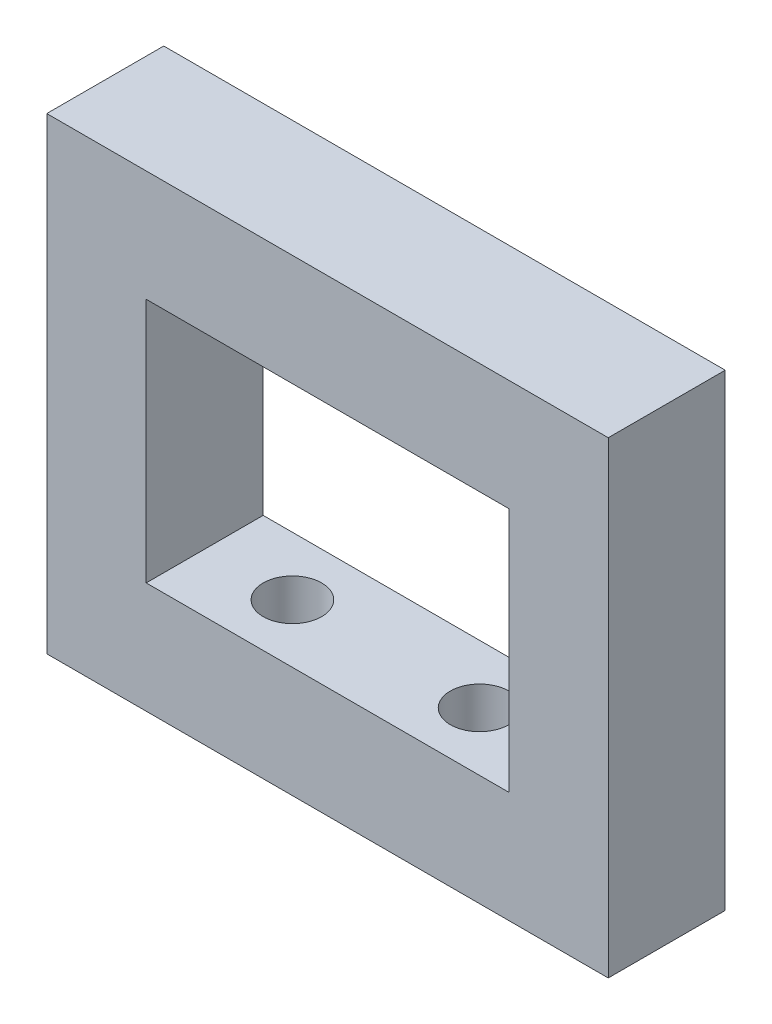
ISO-10303-21;
HEADER;
FILE_DESCRIPTION(('STEP AP214'),'2;1');
FILE_NAME('part.step','',(''),(''),'','','');
FILE_SCHEMA(('AUTOMOTIVE_DESIGN { 1 0 10303 214 1 1 1 1 }'));
ENDSEC;
DATA;
#1=APPLICATION_CONTEXT('core data for automotive mechanical design processes');
#2=APPLICATION_PROTOCOL_DEFINITION('international standard','automotive_design',2000,#1);
#3=PRODUCT_CONTEXT('',#1,'mechanical');
#4=PRODUCT('Part','Part','',(#3));
#5=PRODUCT_RELATED_PRODUCT_CATEGORY('part','',(#4));
#6=PRODUCT_DEFINITION_FORMATION('','',#4);
#7=PRODUCT_DEFINITION_CONTEXT('part definition',#1,'design');
#8=PRODUCT_DEFINITION('design','',#6,#7);
#9=PRODUCT_DEFINITION_SHAPE('','',#8);
#10=(LENGTH_UNIT() NAMED_UNIT(*) SI_UNIT(.MILLI.,.METRE.));
#11=(NAMED_UNIT(*) PLANE_ANGLE_UNIT() SI_UNIT($,.RADIAN.));
#12=(NAMED_UNIT(*) SI_UNIT($,.STERADIAN.) SOLID_ANGLE_UNIT());
#13=UNCERTAINTY_MEASURE_WITH_UNIT(LENGTH_MEASURE(1.E-05),#10,'distance_accuracy_value','');
#14=(GEOMETRIC_REPRESENTATION_CONTEXT(3) GLOBAL_UNCERTAINTY_ASSIGNED_CONTEXT((#13)) GLOBAL_UNIT_ASSIGNED_CONTEXT((#10,
#11,#12)) REPRESENTATION_CONTEXT('',''));
#15=CARTESIAN_POINT('',(0.,0.,0.));
#16=DIRECTION('',(0.,0.,1.));
#17=DIRECTION('',(1.,0.,0.));
#18=AXIS2_PLACEMENT_3D('',#15,#16,#17);
#19=CARTESIAN_POINT('',(12.,-10.,2.5));
#20=DIRECTION('',(-1.,0.,0.));
#21=DIRECTION('',(0.,0.,1.));
#22=AXIS2_PLACEMENT_3D('',#19,#20,#21);
#23=PLANE('',#22);
#24=DIRECTION('',(0.,1.,0.));
#25=VECTOR('',#24,1.);
#26=CARTESIAN_POINT('',(12.,-10.,-2.5));
#27=LINE('',#26,#25);
#28=CARTESIAN_POINT('',(12.,-10.,-2.5));
#29=VERTEX_POINT('',#28);
#30=CARTESIAN_POINT('',(12.,10.,-2.5));
#31=VERTEX_POINT('',#30);
#32=EDGE_CURVE('E134',#29,#31,#27,.T.);
#33=ORIENTED_EDGE('',*,*,#32,.T.);
#34=DIRECTION('',(0.,0.,-1.));
#35=VECTOR('',#34,1.);
#36=CARTESIAN_POINT('',(12.,10.,2.5));
#37=LINE('',#36,#35);
#38=CARTESIAN_POINT('',(12.,10.,2.5));
#39=VERTEX_POINT('',#38);
#40=EDGE_CURVE('E11',#39,#31,#37,.T.);
#41=ORIENTED_EDGE('',*,*,#40,.F.);
#42=DIRECTION('',(0.,1.,0.));
#43=VECTOR('',#42,1.);
#44=CARTESIAN_POINT('',(12.,-10.,2.5));
#45=LINE('',#44,#43);
#46=CARTESIAN_POINT('',(12.,-10.,2.5));
#47=VERTEX_POINT('',#46);
#48=EDGE_CURVE('E138',#47,#39,#45,.T.);
#49=ORIENTED_EDGE('',*,*,#48,.F.);
#50=DIRECTION('',(0.,0.,-1.));
#51=VECTOR('',#50,1.);
#52=CARTESIAN_POINT('',(12.,-10.,2.5));
#53=LINE('',#52,#51);
#54=EDGE_CURVE('E148',#47,#29,#53,.T.);
#55=ORIENTED_EDGE('',*,*,#54,.T.);
#56=EDGE_LOOP('',(#33,#41,#49,#55));
#57=FACE_BOUND('',#56,.T.);
#58=ADVANCED_FACE('F33',(#57),#23,.F.);
#59=CARTESIAN_POINT('',(-12.,10.,2.5));
#60=DIRECTION('',(0.,-1.,0.));
#61=DIRECTION('',(0.,0.,-1.));
#62=AXIS2_PLACEMENT_3D('',#59,#60,#61);
#63=PLANE('',#62);
#64=DIRECTION('',(-1.,0.,0.));
#65=VECTOR('',#64,1.);
#66=CARTESIAN_POINT('',(-12.,10.,-2.5));
#67=LINE('',#66,#65);
#68=CARTESIAN_POINT('',(-12.,10.,-2.5));
#69=VERTEX_POINT('',#68);
#70=EDGE_CURVE('E151',#31,#69,#67,.T.);
#71=ORIENTED_EDGE('',*,*,#70,.T.);
#72=DIRECTION('',(0.,0.,-1.));
#73=VECTOR('',#72,1.);
#74=CARTESIAN_POINT('',(-12.,10.,2.5));
#75=LINE('',#74,#73);
#76=CARTESIAN_POINT('',(-12.,10.,2.5));
#77=VERTEX_POINT('',#76);
#78=EDGE_CURVE('E40',#77,#69,#75,.T.);
#79=ORIENTED_EDGE('',*,*,#78,.F.);
#80=DIRECTION('',(-1.,0.,0.));
#81=VECTOR('',#80,1.);
#82=CARTESIAN_POINT('',(-12.,10.,2.5));
#83=LINE('',#82,#81);
#84=EDGE_CURVE('E141',#39,#77,#83,.T.);
#85=ORIENTED_EDGE('',*,*,#84,.F.);
#86=ORIENTED_EDGE('',*,*,#40,.T.);
#87=EDGE_LOOP('',(#71,#79,#85,#86));
#88=FACE_BOUND('',#87,.T.);
#89=ADVANCED_FACE('F179',(#88),#63,.F.);
#90=CARTESIAN_POINT('',(-12.,-10.,2.5));
#91=DIRECTION('',(1.,0.,0.));
#92=DIRECTION('',(0.,0.,-1.));
#93=AXIS2_PLACEMENT_3D('',#90,#91,#92);
#94=PLANE('',#93);
#95=DIRECTION('',(0.,-1.,0.));
#96=VECTOR('',#95,1.);
#97=CARTESIAN_POINT('',(-12.,-10.,-2.5));
#98=LINE('',#97,#96);
#99=CARTESIAN_POINT('',(-12.,-10.,-2.5));
#100=VERTEX_POINT('',#99);
#101=EDGE_CURVE('E153',#69,#100,#98,.T.);
#102=ORIENTED_EDGE('',*,*,#101,.T.);
#103=DIRECTION('',(0.,0.,-1.));
#104=VECTOR('',#103,1.);
#105=CARTESIAN_POINT('',(-12.,-10.,2.5));
#106=LINE('',#105,#104);
#107=CARTESIAN_POINT('',(-12.,-10.,2.5));
#108=VERTEX_POINT('',#107);
#109=EDGE_CURVE('E158',#108,#100,#106,.T.);
#110=ORIENTED_EDGE('',*,*,#109,.F.);
#111=DIRECTION('',(0.,-1.,0.));
#112=VECTOR('',#111,1.);
#113=CARTESIAN_POINT('',(-12.,-10.,2.5));
#114=LINE('',#113,#112);
#115=EDGE_CURVE('E144',#77,#108,#114,.T.);
#116=ORIENTED_EDGE('',*,*,#115,.F.);
#117=ORIENTED_EDGE('',*,*,#78,.T.);
#118=EDGE_LOOP('',(#102,#110,#116,#117));
#119=FACE_BOUND('',#118,.T.);
#120=ADVANCED_FACE('F165',(#119),#94,.F.);
#121=CARTESIAN_POINT('',(-12.,-10.,2.5));
#122=DIRECTION('',(0.,1.,0.));
#123=DIRECTION('',(0.,0.,1.));
#124=AXIS2_PLACEMENT_3D('',#121,#122,#123);
#125=PLANE('',#124);
#126=CARTESIAN_POINT('',(-4.,-10.,0.));
#127=DIRECTION('',(0.,-1.,0.));
#128=DIRECTION('',(0.,0.,-1.));
#129=AXIS2_PLACEMENT_3D('',#126,#127,#128);
#130=CIRCLE('',#129,1.25);
#131=CARTESIAN_POINT('',(-4.,-10.,-1.25));
#132=VERTEX_POINT('',#131);
#133=EDGE_CURVE('E218',#132,#132,#130,.T.);
#134=ORIENTED_EDGE('',*,*,#133,.F.);
#135=EDGE_LOOP('',(#134));
#136=FACE_BOUND('',#135,.T.);
#137=CARTESIAN_POINT('',(4.,-10.,0.));
#138=DIRECTION('',(0.,-1.,0.));
#139=DIRECTION('',(0.,0.,-1.));
#140=AXIS2_PLACEMENT_3D('',#137,#138,#139);
#141=CIRCLE('',#140,1.25);
#142=CARTESIAN_POINT('',(4.,-10.,-1.25));
#143=VERTEX_POINT('',#142);
#144=EDGE_CURVE('E223',#143,#143,#141,.T.);
#145=ORIENTED_EDGE('',*,*,#144,.F.);
#146=EDGE_LOOP('',(#145));
#147=FACE_BOUND('',#146,.T.);
#148=DIRECTION('',(1.,0.,0.));
#149=VECTOR('',#148,1.);
#150=CARTESIAN_POINT('',(-12.,-10.,-2.5));
#151=LINE('',#150,#149);
#152=EDGE_CURVE('E142',#100,#29,#151,.T.);
#153=ORIENTED_EDGE('',*,*,#152,.T.);
#154=ORIENTED_EDGE('',*,*,#54,.F.);
#155=DIRECTION('',(1.,0.,0.));
#156=VECTOR('',#155,1.);
#157=CARTESIAN_POINT('',(-12.,-10.,2.5));
#158=LINE('',#157,#156);
#159=EDGE_CURVE('E146',#108,#47,#158,.T.);
#160=ORIENTED_EDGE('',*,*,#159,.F.);
#161=ORIENTED_EDGE('',*,*,#109,.T.);
#162=EDGE_LOOP('',(#153,#154,#160,#161));
#163=FACE_BOUND('',#162,.T.);
#164=ADVANCED_FACE('F172',(#136,#147,#163),#125,.F.);
#165=CARTESIAN_POINT('',(0.,0.,2.5));
#166=DIRECTION('',(0.,0.,-1.));
#167=DIRECTION('',(-1.,0.,0.));
#168=AXIS2_PLACEMENT_3D('',#165,#166,#167);
#169=PLANE('',#168);
#170=DIRECTION('',(-1.,0.,0.));
#171=VECTOR('',#170,1.);
#172=CARTESIAN_POINT('',(-7.75,5.25,2.5));
#173=LINE('',#172,#171);
#174=CARTESIAN_POINT('',(7.75,5.25,2.5));
#175=VERTEX_POINT('',#174);
#176=CARTESIAN_POINT('',(-7.75,5.25,2.5));
#177=VERTEX_POINT('',#176);
#178=EDGE_CURVE('E127',#175,#177,#173,.T.);
#179=ORIENTED_EDGE('',*,*,#178,.F.);
#180=DIRECTION('',(0.,1.,0.));
#181=VECTOR('',#180,1.);
#182=CARTESIAN_POINT('',(7.75,-5.25,2.5));
#183=LINE('',#182,#181);
#184=CARTESIAN_POINT('',(7.75,-5.25,2.5));
#185=VERTEX_POINT('',#184);
#186=EDGE_CURVE('E47',#185,#175,#183,.T.);
#187=ORIENTED_EDGE('',*,*,#186,.F.);
#188=DIRECTION('',(1.,0.,0.));
#189=VECTOR('',#188,1.);
#190=CARTESIAN_POINT('',(-7.75,-5.25,2.5));
#191=LINE('',#190,#189);
#192=CARTESIAN_POINT('',(-7.75,-5.25,2.5));
#193=VERTEX_POINT('',#192);
#194=EDGE_CURVE('E115',#193,#185,#191,.T.);
#195=ORIENTED_EDGE('',*,*,#194,.F.);
#196=DIRECTION('',(0.,-1.,0.));
#197=VECTOR('',#196,1.);
#198=CARTESIAN_POINT('',(-7.75,-5.25,2.5));
#199=LINE('',#198,#197);
#200=EDGE_CURVE('E118',#177,#193,#199,.T.);
#201=ORIENTED_EDGE('',*,*,#200,.F.);
#202=EDGE_LOOP('',(#179,#187,#195,#201));
#203=FACE_BOUND('',#202,.T.);
#204=ORIENTED_EDGE('',*,*,#48,.T.);
#205=ORIENTED_EDGE('',*,*,#84,.T.);
#206=ORIENTED_EDGE('',*,*,#115,.T.);
#207=ORIENTED_EDGE('',*,*,#159,.T.);
#208=EDGE_LOOP('',(#204,#205,#206,#207));
#209=FACE_BOUND('',#208,.T.);
#210=ADVANCED_FACE('F178',(#203,#209),#169,.F.);
#211=CARTESIAN_POINT('',(0.,0.,-2.5));
#212=DIRECTION('',(0.,0.,-1.));
#213=DIRECTION('',(-1.,0.,0.));
#214=AXIS2_PLACEMENT_3D('',#211,#212,#213);
#215=PLANE('',#214);
#216=DIRECTION('',(0.,1.,0.));
#217=VECTOR('',#216,1.);
#218=CARTESIAN_POINT('',(7.75,-5.25,-2.5));
#219=LINE('',#218,#217);
#220=CARTESIAN_POINT('',(7.75,-5.25,-2.5));
#221=VERTEX_POINT('',#220);
#222=CARTESIAN_POINT('',(7.75,5.25,-2.5));
#223=VERTEX_POINT('',#222);
#224=EDGE_CURVE('E99',#221,#223,#219,.T.);
#225=ORIENTED_EDGE('',*,*,#224,.T.);
#226=DIRECTION('',(-1.,0.,0.));
#227=VECTOR('',#226,1.);
#228=CARTESIAN_POINT('',(-7.75,5.25,-2.5));
#229=LINE('',#228,#227);
#230=CARTESIAN_POINT('',(-7.75,5.25,-2.5));
#231=VERTEX_POINT('',#230);
#232=EDGE_CURVE('E108',#223,#231,#229,.T.);
#233=ORIENTED_EDGE('',*,*,#232,.T.);
#234=DIRECTION('',(0.,-1.,0.));
#235=VECTOR('',#234,1.);
#236=CARTESIAN_POINT('',(-7.75,-5.25,-2.5));
#237=LINE('',#236,#235);
#238=CARTESIAN_POINT('',(-7.75,-5.25,-2.5));
#239=VERTEX_POINT('',#238);
#240=EDGE_CURVE('E55',#231,#239,#237,.T.);
#241=ORIENTED_EDGE('',*,*,#240,.T.);
#242=DIRECTION('',(1.,0.,0.));
#243=VECTOR('',#242,1.);
#244=CARTESIAN_POINT('',(-7.75,-5.25,-2.5));
#245=LINE('',#244,#243);
#246=EDGE_CURVE('E105',#239,#221,#245,.T.);
#247=ORIENTED_EDGE('',*,*,#246,.T.);
#248=EDGE_LOOP('',(#225,#233,#241,#247));
#249=FACE_BOUND('',#248,.T.);
#250=ORIENTED_EDGE('',*,*,#32,.F.);
#251=ORIENTED_EDGE('',*,*,#152,.F.);
#252=ORIENTED_EDGE('',*,*,#101,.F.);
#253=ORIENTED_EDGE('',*,*,#70,.F.);
#254=EDGE_LOOP('',(#250,#251,#252,#253));
#255=FACE_BOUND('',#254,.T.);
#256=ADVANCED_FACE('F112',(#249,#255),#215,.T.);
#257=CARTESIAN_POINT('',(7.75,-5.25,-2.5));
#258=DIRECTION('',(1.,0.,0.));
#259=DIRECTION('',(0.,0.,-1.));
#260=AXIS2_PLACEMENT_3D('',#257,#258,#259);
#261=PLANE('',#260);
#262=ORIENTED_EDGE('',*,*,#186,.T.);
#263=DIRECTION('',(0.,0.,1.));
#264=VECTOR('',#263,1.);
#265=CARTESIAN_POINT('',(7.75,5.25,-2.5));
#266=LINE('',#265,#264);
#267=EDGE_CURVE('E95',#223,#175,#266,.T.);
#268=ORIENTED_EDGE('',*,*,#267,.F.);
#269=ORIENTED_EDGE('',*,*,#224,.F.);
#270=DIRECTION('',(0.,0.,1.));
#271=VECTOR('',#270,1.);
#272=CARTESIAN_POINT('',(7.75,-5.25,-2.5));
#273=LINE('',#272,#271);
#274=EDGE_CURVE('E132',#221,#185,#273,.T.);
#275=ORIENTED_EDGE('',*,*,#274,.T.);
#276=EDGE_LOOP('',(#262,#268,#269,#275));
#277=FACE_BOUND('',#276,.T.);
#278=ADVANCED_FACE('F97',(#277),#261,.F.);
#279=CARTESIAN_POINT('',(-7.75,-5.25,-2.5));
#280=DIRECTION('',(0.,-1.,0.));
#281=DIRECTION('',(0.,0.,-1.));
#282=AXIS2_PLACEMENT_3D('',#279,#280,#281);
#283=PLANE('',#282);
#284=CARTESIAN_POINT('',(-4.,-5.25,0.));
#285=DIRECTION('',(0.,-1.,0.));
#286=DIRECTION('',(0.,0.,-1.));
#287=AXIS2_PLACEMENT_3D('',#284,#285,#286);
#288=CIRCLE('',#287,1.25);
#289=CARTESIAN_POINT('',(-4.,-5.25,-1.25));
#290=VERTEX_POINT('',#289);
#291=EDGE_CURVE('E128',#290,#290,#288,.F.);
#292=ORIENTED_EDGE('',*,*,#291,.F.);
#293=EDGE_LOOP('',(#292));
#294=FACE_BOUND('',#293,.T.);
#295=CARTESIAN_POINT('',(4.,-5.25,0.));
#296=DIRECTION('',(0.,-1.,0.));
#297=DIRECTION('',(0.,0.,-1.));
#298=AXIS2_PLACEMENT_3D('',#295,#296,#297);
#299=CIRCLE('',#298,1.25);
#300=CARTESIAN_POINT('',(4.,-5.25,-1.25));
#301=VERTEX_POINT('',#300);
#302=EDGE_CURVE('E121',#301,#301,#299,.F.);
#303=ORIENTED_EDGE('',*,*,#302,.F.);
#304=EDGE_LOOP('',(#303));
#305=FACE_BOUND('',#304,.T.);
#306=ORIENTED_EDGE('',*,*,#194,.T.);
#307=ORIENTED_EDGE('',*,*,#274,.F.);
#308=ORIENTED_EDGE('',*,*,#246,.F.);
#309=DIRECTION('',(0.,0.,1.));
#310=VECTOR('',#309,1.);
#311=CARTESIAN_POINT('',(-7.75,-5.25,-2.5));
#312=LINE('',#311,#310);
#313=EDGE_CURVE('E135',#239,#193,#312,.T.);
#314=ORIENTED_EDGE('',*,*,#313,.T.);
#315=EDGE_LOOP('',(#306,#307,#308,#314));
#316=FACE_BOUND('',#315,.T.);
#317=ADVANCED_FACE('F197',(#294,#305,#316),#283,.F.);
#318=CARTESIAN_POINT('',(-7.75,-5.25,-2.5));
#319=DIRECTION('',(-1.,0.,0.));
#320=DIRECTION('',(0.,0.,1.));
#321=AXIS2_PLACEMENT_3D('',#318,#319,#320);
#322=PLANE('',#321);
#323=ORIENTED_EDGE('',*,*,#200,.T.);
#324=ORIENTED_EDGE('',*,*,#313,.F.);
#325=ORIENTED_EDGE('',*,*,#240,.F.);
#326=DIRECTION('',(0.,0.,1.));
#327=VECTOR('',#326,1.);
#328=CARTESIAN_POINT('',(-7.75,5.25,-2.5));
#329=LINE('',#328,#327);
#330=EDGE_CURVE('E104',#231,#177,#329,.T.);
#331=ORIENTED_EDGE('',*,*,#330,.T.);
#332=EDGE_LOOP('',(#323,#324,#325,#331));
#333=FACE_BOUND('',#332,.T.);
#334=ADVANCED_FACE('F201',(#333),#322,.F.);
#335=CARTESIAN_POINT('',(-7.75,5.25,-2.5));
#336=DIRECTION('',(0.,1.,0.));
#337=DIRECTION('',(0.,0.,1.));
#338=AXIS2_PLACEMENT_3D('',#335,#336,#337);
#339=PLANE('',#338);
#340=ORIENTED_EDGE('',*,*,#178,.T.);
#341=ORIENTED_EDGE('',*,*,#330,.F.);
#342=ORIENTED_EDGE('',*,*,#232,.F.);
#343=ORIENTED_EDGE('',*,*,#267,.T.);
#344=EDGE_LOOP('',(#340,#341,#342,#343));
#345=FACE_BOUND('',#344,.T.);
#346=ADVANCED_FACE('F109',(#345),#339,.F.);
#347=CARTESIAN_POINT('',(4.,10.001,0.));
#348=DIRECTION('',(0.,-1.,0.));
#349=DIRECTION('',(0.,0.,-1.));
#350=AXIS2_PLACEMENT_3D('',#347,#348,#349);
#351=CYLINDRICAL_SURFACE('',#350,1.25);
#352=ORIENTED_EDGE('',*,*,#144,.T.);
#353=EDGE_LOOP('',(#352));
#354=FACE_BOUND('',#353,.T.);
#355=ORIENTED_EDGE('',*,*,#302,.T.);
#356=EDGE_LOOP('',(#355));
#357=FACE_BOUND('',#356,.T.);
#358=ADVANCED_FACE('F200',(#354,#357),#351,.F.);
#359=CARTESIAN_POINT('',(-4.,10.001,0.));
#360=DIRECTION('',(0.,-1.,0.));
#361=DIRECTION('',(0.,0.,-1.));
#362=AXIS2_PLACEMENT_3D('',#359,#360,#361);
#363=CYLINDRICAL_SURFACE('',#362,1.25);
#364=ORIENTED_EDGE('',*,*,#133,.T.);
#365=EDGE_LOOP('',(#364));
#366=FACE_BOUND('',#365,.T.);
#367=ORIENTED_EDGE('',*,*,#291,.T.);
#368=EDGE_LOOP('',(#367));
#369=FACE_BOUND('',#368,.T.);
#370=ADVANCED_FACE('F209',(#366,#369),#363,.F.);
#371=CLOSED_SHELL('',(#58,#89,#120,#164,#210,#256,#278,#317,#334,#346,#358,#370));
#372=MANIFOLD_SOLID_BREP('B2',#371);
#373=ADVANCED_BREP_SHAPE_REPRESENTATION('',(#18,#372),#14);
#374=SHAPE_DEFINITION_REPRESENTATION(#9,#373);
ENDSEC;
END-ISO-10303-21;
